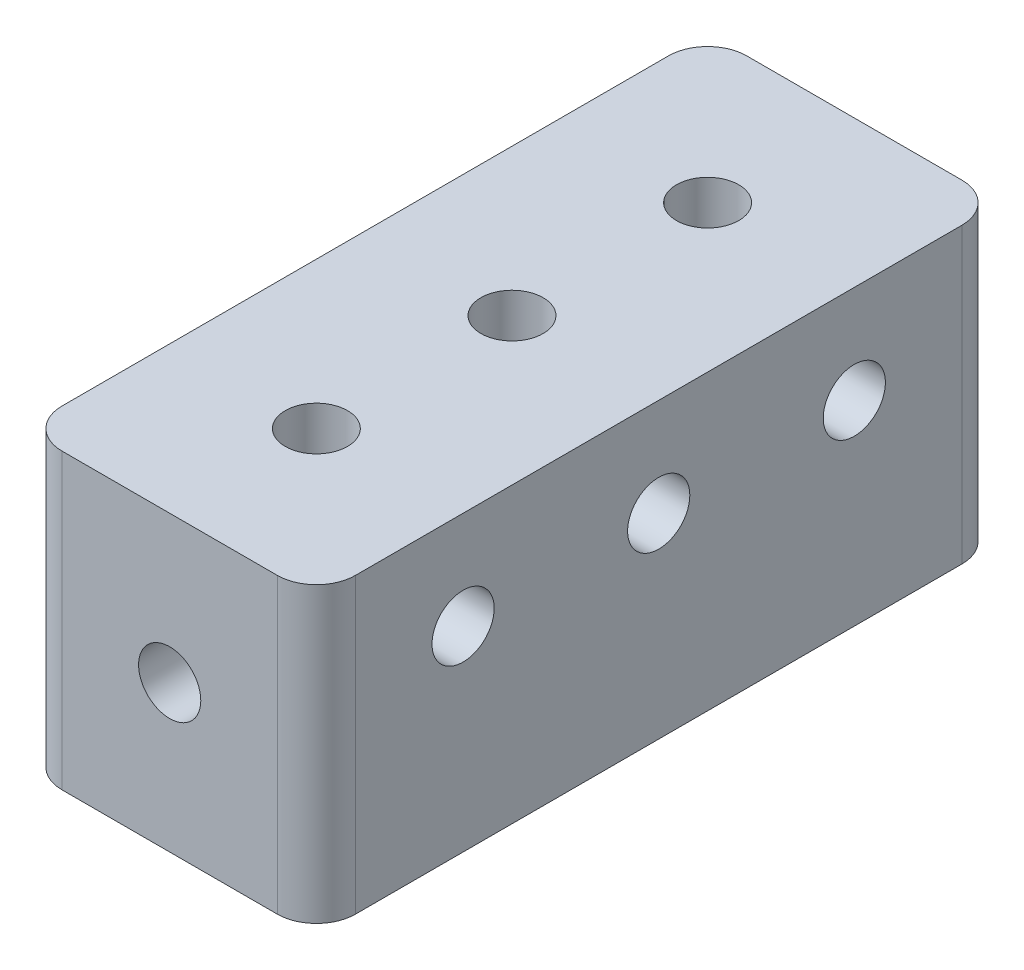
ISO-10303-21;
HEADER;
FILE_DESCRIPTION(('STEP AP214'),'2;1');
FILE_NAME('part.step','',(''),(''),'','','');
FILE_SCHEMA(('AUTOMOTIVE_DESIGN { 1 0 10303 214 1 1 1 1 }'));
ENDSEC;
DATA;
#1=APPLICATION_CONTEXT('core data for automotive mechanical design processes');
#2=APPLICATION_PROTOCOL_DEFINITION('international standard','automotive_design',2000,#1);
#3=PRODUCT_CONTEXT('',#1,'mechanical');
#4=PRODUCT('Part','Part','',(#3));
#5=PRODUCT_RELATED_PRODUCT_CATEGORY('part','',(#4));
#6=PRODUCT_DEFINITION_FORMATION('','',#4);
#7=PRODUCT_DEFINITION_CONTEXT('part definition',#1,'design');
#8=PRODUCT_DEFINITION('design','',#6,#7);
#9=PRODUCT_DEFINITION_SHAPE('','',#8);
#10=(LENGTH_UNIT() NAMED_UNIT(*) SI_UNIT(.MILLI.,.METRE.));
#11=(NAMED_UNIT(*) PLANE_ANGLE_UNIT() SI_UNIT($,.RADIAN.));
#12=(NAMED_UNIT(*) SI_UNIT($,.STERADIAN.) SOLID_ANGLE_UNIT());
#13=UNCERTAINTY_MEASURE_WITH_UNIT(LENGTH_MEASURE(1.E-05),#10,'distance_accuracy_value','');
#14=(GEOMETRIC_REPRESENTATION_CONTEXT(3) GLOBAL_UNCERTAINTY_ASSIGNED_CONTEXT((#13)) GLOBAL_UNIT_ASSIGNED_CONTEXT((#10,
#11,#12)) REPRESENTATION_CONTEXT('',''));
#15=CARTESIAN_POINT('',(0.,0.,0.));
#16=DIRECTION('',(0.,0.,1.));
#17=DIRECTION('',(1.,0.,0.));
#18=AXIS2_PLACEMENT_3D('',#15,#16,#17);
#19=CARTESIAN_POINT('',(9.525,9.525,22.225));
#20=DIRECTION('',(-1.,0.,0.));
#21=DIRECTION('',(0.,0.,1.));
#22=AXIS2_PLACEMENT_3D('',#19,#20,#21);
#23=PLANE('',#22);
#24=CARTESIAN_POINT('',(9.525,3.175,12.7));
#25=DIRECTION('',(1.,0.,0.));
#26=DIRECTION('',(0.,0.,-1.));
#27=AXIS2_PLACEMENT_3D('',#24,#25,#26);
#28=CIRCLE('',#27,2.0193);
#29=CARTESIAN_POINT('',(9.525,3.175,10.6807));
#30=VERTEX_POINT('',#29);
#31=EDGE_CURVE('E208',#30,#30,#28,.T.);
#32=ORIENTED_EDGE('',*,*,#31,.F.);
#33=EDGE_LOOP('',(#32));
#34=FACE_BOUND('',#33,.T.);
#35=CARTESIAN_POINT('',(9.525,3.175,-12.7));
#36=DIRECTION('',(1.,0.,0.));
#37=DIRECTION('',(0.,0.,-1.));
#38=AXIS2_PLACEMENT_3D('',#35,#36,#37);
#39=CIRCLE('',#38,2.0193);
#40=CARTESIAN_POINT('',(9.525,3.175,-14.7193));
#41=VERTEX_POINT('',#40);
#42=EDGE_CURVE('E202',#41,#41,#39,.T.);
#43=ORIENTED_EDGE('',*,*,#42,.F.);
#44=EDGE_LOOP('',(#43));
#45=FACE_BOUND('',#44,.T.);
#46=CARTESIAN_POINT('',(9.525,3.175,0.));
#47=DIRECTION('',(1.,0.,0.));
#48=DIRECTION('',(0.,0.,-1.));
#49=AXIS2_PLACEMENT_3D('',#46,#47,#48);
#50=CIRCLE('',#49,2.0193);
#51=CARTESIAN_POINT('',(9.525,3.175,-2.0193));
#52=VERTEX_POINT('',#51);
#53=EDGE_CURVE('E195',#52,#52,#50,.T.);
#54=ORIENTED_EDGE('',*,*,#53,.F.);
#55=EDGE_LOOP('',(#54));
#56=FACE_BOUND('',#55,.T.);
#57=DIRECTION('',(0.,0.,-1.));
#58=VECTOR('',#57,1.);
#59=CARTESIAN_POINT('',(9.525,9.525,22.225));
#60=LINE('',#59,#58);
#61=CARTESIAN_POINT('',(9.525,9.525,19.685));
#62=VERTEX_POINT('',#61);
#63=CARTESIAN_POINT('',(9.525,9.525,-19.685));
#64=VERTEX_POINT('',#63);
#65=EDGE_CURVE('E126',#62,#64,#60,.T.);
#66=ORIENTED_EDGE('',*,*,#65,.F.);
#67=DIRECTION('',(0.,-1.,0.));
#68=VECTOR('',#67,1.);
#69=CARTESIAN_POINT('',(9.525,9.525,19.685));
#70=LINE('',#69,#68);
#71=CARTESIAN_POINT('',(9.525,-9.525,19.685));
#72=VERTEX_POINT('',#71);
#73=EDGE_CURVE('E111',#62,#72,#70,.T.);
#74=ORIENTED_EDGE('',*,*,#73,.T.);
#75=DIRECTION('',(0.,0.,-1.));
#76=VECTOR('',#75,1.);
#77=CARTESIAN_POINT('',(9.525,-9.525,22.225));
#78=LINE('',#77,#76);
#79=CARTESIAN_POINT('',(9.525,-9.525,-19.685));
#80=VERTEX_POINT('',#79);
#81=EDGE_CURVE('E123',#72,#80,#78,.T.);
#82=ORIENTED_EDGE('',*,*,#81,.T.);
#83=DIRECTION('',(0.,-1.,0.));
#84=VECTOR('',#83,1.);
#85=CARTESIAN_POINT('',(9.525,9.525,-19.685));
#86=LINE('',#85,#84);
#87=EDGE_CURVE('E128',#80,#64,#86,.F.);
#88=ORIENTED_EDGE('',*,*,#87,.T.);
#89=EDGE_LOOP('',(#66,#74,#82,#88));
#90=FACE_BOUND('',#89,.T.);
#91=ADVANCED_FACE('F41',(#34,#45,#56,#90),#23,.F.);
#92=CARTESIAN_POINT('',(-9.525,9.525,-22.225));
#93=DIRECTION('',(0.,0.,1.));
#94=DIRECTION('',(1.,0.,0.));
#95=AXIS2_PLACEMENT_3D('',#92,#93,#94);
#96=PLANE('',#95);
#97=CARTESIAN_POINT('',(0.,0.,-22.225));
#98=DIRECTION('',(0.,0.,-1.));
#99=DIRECTION('',(-1.,0.,0.));
#100=AXIS2_PLACEMENT_3D('',#97,#98,#99);
#101=CIRCLE('',#100,2.0193);
#102=CARTESIAN_POINT('',(-2.0193,0.,-22.225));
#103=VERTEX_POINT('',#102);
#104=EDGE_CURVE('E189',#103,#103,#101,.T.);
#105=ORIENTED_EDGE('',*,*,#104,.F.);
#106=EDGE_LOOP('',(#105));
#107=FACE_BOUND('',#106,.T.);
#108=DIRECTION('',(-1.,0.,0.));
#109=VECTOR('',#108,1.);
#110=CARTESIAN_POINT('',(-9.525,-9.525,-22.225));
#111=LINE('',#110,#109);
#112=CARTESIAN_POINT('',(6.98499999999999,-9.525,-22.225));
#113=VERTEX_POINT('',#112);
#114=CARTESIAN_POINT('',(-6.985,-9.525,-22.225));
#115=VERTEX_POINT('',#114);
#116=EDGE_CURVE('E132',#113,#115,#111,.T.);
#117=ORIENTED_EDGE('',*,*,#116,.T.);
#118=DIRECTION('',(0.,-1.,0.));
#119=VECTOR('',#118,1.);
#120=CARTESIAN_POINT('',(-6.985,9.525,-22.225));
#121=LINE('',#120,#119);
#122=CARTESIAN_POINT('',(-6.985,9.525,-22.225));
#123=VERTEX_POINT('',#122);
#124=EDGE_CURVE('E11',#115,#123,#121,.F.);
#125=ORIENTED_EDGE('',*,*,#124,.T.);
#126=DIRECTION('',(-1.,0.,0.));
#127=VECTOR('',#126,1.);
#128=CARTESIAN_POINT('',(-9.525,9.525,-22.225));
#129=LINE('',#128,#127);
#130=CARTESIAN_POINT('',(6.98499999999999,9.525,-22.225));
#131=VERTEX_POINT('',#130);
#132=EDGE_CURVE('E172',#131,#123,#129,.T.);
#133=ORIENTED_EDGE('',*,*,#132,.F.);
#134=DIRECTION('',(0.,-1.,0.));
#135=VECTOR('',#134,1.);
#136=CARTESIAN_POINT('',(6.985,9.525,-22.225));
#137=LINE('',#136,#135);
#138=EDGE_CURVE('E49',#131,#113,#137,.T.);
#139=ORIENTED_EDGE('',*,*,#138,.T.);
#140=EDGE_LOOP('',(#117,#125,#133,#139));
#141=FACE_BOUND('',#140,.T.);
#142=ADVANCED_FACE('F170',(#107,#141),#96,.F.);
#143=CARTESIAN_POINT('',(-9.525,9.525,22.225));
#144=DIRECTION('',(1.,0.,0.));
#145=DIRECTION('',(0.,0.,-1.));
#146=AXIS2_PLACEMENT_3D('',#143,#144,#145);
#147=PLANE('',#146);
#148=CARTESIAN_POINT('',(-9.525,3.175,-12.7));
#149=DIRECTION('',(-1.,0.,0.));
#150=DIRECTION('',(0.,0.,1.));
#151=AXIS2_PLACEMENT_3D('',#148,#149,#150);
#152=CIRCLE('',#151,2.0193);
#153=CARTESIAN_POINT('',(-9.525,3.175,-10.6807));
#154=VERTEX_POINT('',#153);
#155=EDGE_CURVE('E226',#154,#154,#152,.T.);
#156=ORIENTED_EDGE('',*,*,#155,.F.);
#157=EDGE_LOOP('',(#156));
#158=FACE_BOUND('',#157,.T.);
#159=CARTESIAN_POINT('',(-9.525,3.175,0.));
#160=DIRECTION('',(-1.,0.,0.));
#161=DIRECTION('',(0.,0.,1.));
#162=AXIS2_PLACEMENT_3D('',#159,#160,#161);
#163=CIRCLE('',#162,2.0193);
#164=CARTESIAN_POINT('',(-9.525,3.175,2.0193));
#165=VERTEX_POINT('',#164);
#166=EDGE_CURVE('E220',#165,#165,#163,.T.);
#167=ORIENTED_EDGE('',*,*,#166,.F.);
#168=EDGE_LOOP('',(#167));
#169=FACE_BOUND('',#168,.T.);
#170=CARTESIAN_POINT('',(-9.525,3.175,12.7));
#171=DIRECTION('',(-1.,0.,0.));
#172=DIRECTION('',(0.,0.,1.));
#173=AXIS2_PLACEMENT_3D('',#170,#171,#172);
#174=CIRCLE('',#173,2.0193);
#175=CARTESIAN_POINT('',(-9.525,3.175,14.7193));
#176=VERTEX_POINT('',#175);
#177=EDGE_CURVE('E213',#176,#176,#174,.T.);
#178=ORIENTED_EDGE('',*,*,#177,.F.);
#179=EDGE_LOOP('',(#178));
#180=FACE_BOUND('',#179,.T.);
#181=DIRECTION('',(0.,0.,1.));
#182=VECTOR('',#181,1.);
#183=CARTESIAN_POINT('',(-9.525,-9.525,22.225));
#184=LINE('',#183,#182);
#185=CARTESIAN_POINT('',(-9.525,-9.525,-19.685));
#186=VERTEX_POINT('',#185);
#187=CARTESIAN_POINT('',(-9.525,-9.525,19.685));
#188=VERTEX_POINT('',#187);
#189=EDGE_CURVE('E136',#186,#188,#184,.T.);
#190=ORIENTED_EDGE('',*,*,#189,.T.);
#191=DIRECTION('',(0.,-1.,0.));
#192=VECTOR('',#191,1.);
#193=CARTESIAN_POINT('',(-9.525,9.525,19.685));
#194=LINE('',#193,#192);
#195=CARTESIAN_POINT('',(-9.525,9.525,19.685));
#196=VERTEX_POINT('',#195);
#197=EDGE_CURVE('E56',#188,#196,#194,.F.);
#198=ORIENTED_EDGE('',*,*,#197,.T.);
#199=DIRECTION('',(0.,0.,1.));
#200=VECTOR('',#199,1.);
#201=CARTESIAN_POINT('',(-9.525,9.525,22.225));
#202=LINE('',#201,#200);
#203=CARTESIAN_POINT('',(-9.525,9.525,-19.685));
#204=VERTEX_POINT('',#203);
#205=EDGE_CURVE('E180',#204,#196,#202,.T.);
#206=ORIENTED_EDGE('',*,*,#205,.F.);
#207=DIRECTION('',(0.,-1.,0.));
#208=VECTOR('',#207,1.);
#209=CARTESIAN_POINT('',(-9.525,9.525,-19.685));
#210=LINE('',#209,#208);
#211=EDGE_CURVE('E163',#204,#186,#210,.T.);
#212=ORIENTED_EDGE('',*,*,#211,.T.);
#213=EDGE_LOOP('',(#190,#198,#206,#212));
#214=FACE_BOUND('',#213,.T.);
#215=ADVANCED_FACE('F179',(#158,#169,#180,#214),#147,.F.);
#216=CARTESIAN_POINT('',(-9.525,9.525,22.225));
#217=DIRECTION('',(0.,0.,-1.));
#218=DIRECTION('',(-1.,0.,0.));
#219=AXIS2_PLACEMENT_3D('',#216,#217,#218);
#220=PLANE('',#219);
#221=CARTESIAN_POINT('',(0.,0.,22.225));
#222=DIRECTION('',(0.,0.,1.));
#223=DIRECTION('',(1.,0.,0.));
#224=AXIS2_PLACEMENT_3D('',#221,#222,#223);
#225=CIRCLE('',#224,2.0193);
#226=CARTESIAN_POINT('',(2.0193,0.,22.225));
#227=VERTEX_POINT('',#226);
#228=EDGE_CURVE('E139',#227,#227,#225,.T.);
#229=ORIENTED_EDGE('',*,*,#228,.F.);
#230=EDGE_LOOP('',(#229));
#231=FACE_BOUND('',#230,.T.);
#232=DIRECTION('',(1.,0.,0.));
#233=VECTOR('',#232,1.);
#234=CARTESIAN_POINT('',(-9.525,-9.525,22.225));
#235=LINE('',#234,#233);
#236=CARTESIAN_POINT('',(-6.985,-9.525,22.225));
#237=VERTEX_POINT('',#236);
#238=CARTESIAN_POINT('',(6.98499999999999,-9.525,22.225));
#239=VERTEX_POINT('',#238);
#240=EDGE_CURVE('E146',#237,#239,#235,.T.);
#241=ORIENTED_EDGE('',*,*,#240,.T.);
#242=DIRECTION('',(0.,-1.,0.));
#243=VECTOR('',#242,1.);
#244=CARTESIAN_POINT('',(6.985,9.525,22.225));
#245=LINE('',#244,#243);
#246=CARTESIAN_POINT('',(6.98499999999999,9.525,22.225));
#247=VERTEX_POINT('',#246);
#248=EDGE_CURVE('E112',#239,#247,#245,.F.);
#249=ORIENTED_EDGE('',*,*,#248,.T.);
#250=DIRECTION('',(1.,0.,0.));
#251=VECTOR('',#250,1.);
#252=CARTESIAN_POINT('',(-9.525,9.525,22.225));
#253=LINE('',#252,#251);
#254=CARTESIAN_POINT('',(-6.985,9.525,22.225));
#255=VERTEX_POINT('',#254);
#256=EDGE_CURVE('E142',#255,#247,#253,.T.);
#257=ORIENTED_EDGE('',*,*,#256,.F.);
#258=DIRECTION('',(0.,-1.,0.));
#259=VECTOR('',#258,1.);
#260=CARTESIAN_POINT('',(-6.985,9.525,22.225));
#261=LINE('',#260,#259);
#262=EDGE_CURVE('E117',#255,#237,#261,.T.);
#263=ORIENTED_EDGE('',*,*,#262,.T.);
#264=EDGE_LOOP('',(#241,#249,#257,#263));
#265=FACE_BOUND('',#264,.T.);
#266=ADVANCED_FACE('F261',(#231,#265),#220,.F.);
#267=CARTESIAN_POINT('',(0.,9.525,0.));
#268=DIRECTION('',(0.,-1.,0.));
#269=DIRECTION('',(0.,0.,-1.));
#270=AXIS2_PLACEMENT_3D('',#267,#268,#269);
#271=PLANE('',#270);
#272=CARTESIAN_POINT('',(0.,9.525,-12.7));
#273=DIRECTION('',(0.,1.,0.));
#274=DIRECTION('',(0.,0.,1.));
#275=AXIS2_PLACEMENT_3D('',#272,#273,#274);
#276=CIRCLE('',#275,2.0193);
#277=CARTESIAN_POINT('',(0.,9.525,-10.6807));
#278=VERTEX_POINT('',#277);
#279=EDGE_CURVE('E243',#278,#278,#276,.T.);
#280=ORIENTED_EDGE('',*,*,#279,.F.);
#281=EDGE_LOOP('',(#280));
#282=FACE_BOUND('',#281,.T.);
#283=CARTESIAN_POINT('',(0.,9.525,0.));
#284=DIRECTION('',(0.,1.,0.));
#285=DIRECTION('',(0.,0.,1.));
#286=AXIS2_PLACEMENT_3D('',#283,#284,#285);
#287=CIRCLE('',#286,2.0193);
#288=CARTESIAN_POINT('',(0.,9.525,2.0193));
#289=VERTEX_POINT('',#288);
#290=EDGE_CURVE('E237',#289,#289,#287,.T.);
#291=ORIENTED_EDGE('',*,*,#290,.F.);
#292=EDGE_LOOP('',(#291));
#293=FACE_BOUND('',#292,.T.);
#294=CARTESIAN_POINT('',(0.,9.525,12.7));
#295=DIRECTION('',(0.,1.,0.));
#296=DIRECTION('',(0.,0.,1.));
#297=AXIS2_PLACEMENT_3D('',#294,#295,#296);
#298=CIRCLE('',#297,2.0193);
#299=CARTESIAN_POINT('',(0.,9.525,14.7193));
#300=VERTEX_POINT('',#299);
#301=EDGE_CURVE('E231',#300,#300,#298,.T.);
#302=ORIENTED_EDGE('',*,*,#301,.F.);
#303=EDGE_LOOP('',(#302));
#304=FACE_BOUND('',#303,.T.);
#305=ORIENTED_EDGE('',*,*,#256,.T.);
#306=CARTESIAN_POINT('',(6.985,9.525,19.685));
#307=DIRECTION('',(0.,-1.,0.));
#308=DIRECTION('',(0.,0.,-1.));
#309=AXIS2_PLACEMENT_3D('',#306,#307,#308);
#310=CIRCLE('',#309,2.54);
#311=EDGE_CURVE('E161',#247,#62,#310,.F.);
#312=ORIENTED_EDGE('',*,*,#311,.T.);
#313=ORIENTED_EDGE('',*,*,#65,.T.);
#314=CARTESIAN_POINT('',(6.985,9.525,-19.685));
#315=DIRECTION('',(0.,-1.,0.));
#316=DIRECTION('',(0.,0.,-1.));
#317=AXIS2_PLACEMENT_3D('',#314,#315,#316);
#318=CIRCLE('',#317,2.54);
#319=EDGE_CURVE('E156',#64,#131,#318,.F.);
#320=ORIENTED_EDGE('',*,*,#319,.T.);
#321=ORIENTED_EDGE('',*,*,#132,.T.);
#322=CARTESIAN_POINT('',(-6.985,9.525,-19.685));
#323=DIRECTION('',(0.,-1.,0.));
#324=DIRECTION('',(0.,0.,-1.));
#325=AXIS2_PLACEMENT_3D('',#322,#323,#324);
#326=CIRCLE('',#325,2.54);
#327=EDGE_CURVE('E63',#123,#204,#326,.F.);
#328=ORIENTED_EDGE('',*,*,#327,.T.);
#329=ORIENTED_EDGE('',*,*,#205,.T.);
#330=CARTESIAN_POINT('',(-6.985,9.525,19.685));
#331=DIRECTION('',(0.,-1.,0.));
#332=DIRECTION('',(0.,0.,-1.));
#333=AXIS2_PLACEMENT_3D('',#330,#331,#332);
#334=CIRCLE('',#333,2.54);
#335=EDGE_CURVE('E159',#196,#255,#334,.F.);
#336=ORIENTED_EDGE('',*,*,#335,.T.);
#337=EDGE_LOOP('',(#305,#312,#313,#320,#321,#328,#329,#336));
#338=FACE_BOUND('',#337,.T.);
#339=ADVANCED_FACE('F258',(#282,#293,#304,#338),#271,.F.);
#340=CARTESIAN_POINT('',(0.,-9.525,0.));
#341=DIRECTION('',(0.,-1.,0.));
#342=DIRECTION('',(0.,0.,-1.));
#343=AXIS2_PLACEMENT_3D('',#340,#341,#342);
#344=PLANE('',#343);
#345=ORIENTED_EDGE('',*,*,#81,.F.);
#346=CARTESIAN_POINT('',(6.985,-9.525,19.685));
#347=DIRECTION('',(0.,-1.,0.));
#348=DIRECTION('',(0.,0.,-1.));
#349=AXIS2_PLACEMENT_3D('',#346,#347,#348);
#350=CIRCLE('',#349,2.54);
#351=EDGE_CURVE('E107',#72,#239,#350,.T.);
#352=ORIENTED_EDGE('',*,*,#351,.T.);
#353=ORIENTED_EDGE('',*,*,#240,.F.);
#354=CARTESIAN_POINT('',(-6.985,-9.525,19.685));
#355=DIRECTION('',(0.,-1.,0.));
#356=DIRECTION('',(0.,0.,-1.));
#357=AXIS2_PLACEMENT_3D('',#354,#355,#356);
#358=CIRCLE('',#357,2.54);
#359=EDGE_CURVE('E118',#237,#188,#358,.T.);
#360=ORIENTED_EDGE('',*,*,#359,.T.);
#361=ORIENTED_EDGE('',*,*,#189,.F.);
#362=CARTESIAN_POINT('',(-6.985,-9.525,-19.685));
#363=DIRECTION('',(0.,-1.,0.));
#364=DIRECTION('',(0.,0.,-1.));
#365=AXIS2_PLACEMENT_3D('',#362,#363,#364);
#366=CIRCLE('',#365,2.54);
#367=EDGE_CURVE('E150',#186,#115,#366,.T.);
#368=ORIENTED_EDGE('',*,*,#367,.T.);
#369=ORIENTED_EDGE('',*,*,#116,.F.);
#370=CARTESIAN_POINT('',(6.985,-9.525,-19.685));
#371=DIRECTION('',(0.,-1.,0.));
#372=DIRECTION('',(0.,0.,-1.));
#373=AXIS2_PLACEMENT_3D('',#370,#371,#372);
#374=CIRCLE('',#373,2.54);
#375=EDGE_CURVE('E127',#113,#80,#374,.T.);
#376=ORIENTED_EDGE('',*,*,#375,.T.);
#377=EDGE_LOOP('',(#345,#352,#353,#360,#361,#368,#369,#376));
#378=FACE_BOUND('',#377,.T.);
#379=ADVANCED_FACE('F130',(#378),#344,.T.);
#380=CARTESIAN_POINT('',(0.,0.,12.7));
#381=DIRECTION('',(0.,0.,1.));
#382=DIRECTION('',(1.,0.,0.));
#383=AXIS2_PLACEMENT_3D('',#380,#381,#382);
#384=CYLINDRICAL_SURFACE('',#383,2.0193);
#385=CARTESIAN_POINT('',(0.,0.,12.7));
#386=DIRECTION('',(0.,0.,1.));
#387=DIRECTION('',(1.,0.,0.));
#388=AXIS2_PLACEMENT_3D('',#385,#386,#387);
#389=CIRCLE('',#388,2.0193);
#390=CARTESIAN_POINT('',(2.0193,0.,12.7));
#391=VERTEX_POINT('',#390);
#392=EDGE_CURVE('E133',#391,#391,#389,.T.);
#393=ORIENTED_EDGE('',*,*,#392,.F.);
#394=EDGE_LOOP('',(#393));
#395=FACE_BOUND('',#394,.T.);
#396=ORIENTED_EDGE('',*,*,#228,.T.);
#397=EDGE_LOOP('',(#396));
#398=FACE_BOUND('',#397,.T.);
#399=ADVANCED_FACE('F296',(#395,#398),#384,.F.);
#400=CARTESIAN_POINT('',(0.,0.,12.7));
#401=DIRECTION('',(0.,0.,1.));
#402=DIRECTION('',(1.,0.,0.));
#403=AXIS2_PLACEMENT_3D('',#400,#401,#402);
#404=PLANE('',#403);
#405=ORIENTED_EDGE('',*,*,#392,.T.);
#406=EDGE_LOOP('',(#405));
#407=FACE_BOUND('',#406,.T.);
#408=ADVANCED_FACE('F300',(#407),#404,.T.);
#409=CARTESIAN_POINT('',(0.,0.,-12.7));
#410=DIRECTION('',(0.,0.,-1.));
#411=DIRECTION('',(-1.,0.,0.));
#412=AXIS2_PLACEMENT_3D('',#409,#410,#411);
#413=CYLINDRICAL_SURFACE('',#412,2.0193);
#414=CARTESIAN_POINT('',(0.,0.,-12.7));
#415=DIRECTION('',(0.,0.,-1.));
#416=DIRECTION('',(-1.,0.,0.));
#417=AXIS2_PLACEMENT_3D('',#414,#415,#416);
#418=CIRCLE('',#417,2.0193);
#419=CARTESIAN_POINT('',(-2.0193,0.,-12.7));
#420=VERTEX_POINT('',#419);
#421=EDGE_CURVE('E187',#420,#420,#418,.T.);
#422=ORIENTED_EDGE('',*,*,#421,.F.);
#423=EDGE_LOOP('',(#422));
#424=FACE_BOUND('',#423,.T.);
#425=ORIENTED_EDGE('',*,*,#104,.T.);
#426=EDGE_LOOP('',(#425));
#427=FACE_BOUND('',#426,.T.);
#428=ADVANCED_FACE('F304',(#424,#427),#413,.F.);
#429=CARTESIAN_POINT('',(0.,0.,-12.7));
#430=DIRECTION('',(0.,0.,-1.));
#431=DIRECTION('',(-1.,0.,0.));
#432=AXIS2_PLACEMENT_3D('',#429,#430,#431);
#433=PLANE('',#432);
#434=ORIENTED_EDGE('',*,*,#421,.T.);
#435=EDGE_LOOP('',(#434));
#436=FACE_BOUND('',#435,.T.);
#437=ADVANCED_FACE('F308',(#436),#433,.T.);
#438=CARTESIAN_POINT('',(3.175,3.175,0.));
#439=DIRECTION('',(1.,0.,0.));
#440=DIRECTION('',(0.,0.,-1.));
#441=AXIS2_PLACEMENT_3D('',#438,#439,#440);
#442=CYLINDRICAL_SURFACE('',#441,2.0193);
#443=CARTESIAN_POINT('',(3.175,3.175,0.));
#444=DIRECTION('',(1.,0.,0.));
#445=DIRECTION('',(0.,0.,-1.));
#446=AXIS2_PLACEMENT_3D('',#443,#444,#445);
#447=CIRCLE('',#446,2.0193);
#448=CARTESIAN_POINT('',(3.175,3.175,-2.0193));
#449=VERTEX_POINT('',#448);
#450=EDGE_CURVE('E198',#449,#449,#447,.T.);
#451=ORIENTED_EDGE('',*,*,#450,.F.);
#452=EDGE_LOOP('',(#451));
#453=FACE_BOUND('',#452,.T.);
#454=ORIENTED_EDGE('',*,*,#53,.T.);
#455=EDGE_LOOP('',(#454));
#456=FACE_BOUND('',#455,.T.);
#457=ADVANCED_FACE('F312',(#453,#456),#442,.F.);
#458=CARTESIAN_POINT('',(3.175,3.175,0.));
#459=DIRECTION('',(1.,0.,0.));
#460=DIRECTION('',(0.,0.,-1.));
#461=AXIS2_PLACEMENT_3D('',#458,#459,#460);
#462=PLANE('',#461);
#463=ORIENTED_EDGE('',*,*,#450,.T.);
#464=EDGE_LOOP('',(#463));
#465=FACE_BOUND('',#464,.T.);
#466=ADVANCED_FACE('F316',(#465),#462,.T.);
#467=CARTESIAN_POINT('',(3.175,3.175,-12.7));
#468=DIRECTION('',(1.,0.,0.));
#469=DIRECTION('',(0.,0.,-1.));
#470=AXIS2_PLACEMENT_3D('',#467,#468,#469);
#471=CYLINDRICAL_SURFACE('',#470,2.0193);
#472=CARTESIAN_POINT('',(3.175,3.175,-12.7));
#473=DIRECTION('',(1.,0.,0.));
#474=DIRECTION('',(0.,0.,-1.));
#475=AXIS2_PLACEMENT_3D('',#472,#473,#474);
#476=CIRCLE('',#475,2.0193);
#477=CARTESIAN_POINT('',(3.175,3.175,-14.7193));
#478=VERTEX_POINT('',#477);
#479=EDGE_CURVE('E205',#478,#478,#476,.T.);
#480=ORIENTED_EDGE('',*,*,#479,.F.);
#481=EDGE_LOOP('',(#480));
#482=FACE_BOUND('',#481,.T.);
#483=ORIENTED_EDGE('',*,*,#42,.T.);
#484=EDGE_LOOP('',(#483));
#485=FACE_BOUND('',#484,.T.);
#486=ADVANCED_FACE('F320',(#482,#485),#471,.F.);
#487=CARTESIAN_POINT('',(3.175,3.175,-12.7));
#488=DIRECTION('',(1.,0.,0.));
#489=DIRECTION('',(0.,0.,-1.));
#490=AXIS2_PLACEMENT_3D('',#487,#488,#489);
#491=PLANE('',#490);
#492=ORIENTED_EDGE('',*,*,#479,.T.);
#493=EDGE_LOOP('',(#492));
#494=FACE_BOUND('',#493,.T.);
#495=ADVANCED_FACE('F324',(#494),#491,.T.);
#496=CARTESIAN_POINT('',(3.175,3.175,12.7));
#497=DIRECTION('',(1.,0.,0.));
#498=DIRECTION('',(0.,0.,-1.));
#499=AXIS2_PLACEMENT_3D('',#496,#497,#498);
#500=CYLINDRICAL_SURFACE('',#499,2.0193);
#501=CARTESIAN_POINT('',(3.175,3.175,12.7));
#502=DIRECTION('',(1.,0.,0.));
#503=DIRECTION('',(0.,0.,-1.));
#504=AXIS2_PLACEMENT_3D('',#501,#502,#503);
#505=CIRCLE('',#504,2.0193);
#506=CARTESIAN_POINT('',(3.175,3.175,10.6807));
#507=VERTEX_POINT('',#506);
#508=EDGE_CURVE('E192',#507,#507,#505,.T.);
#509=ORIENTED_EDGE('',*,*,#508,.F.);
#510=EDGE_LOOP('',(#509));
#511=FACE_BOUND('',#510,.T.);
#512=ORIENTED_EDGE('',*,*,#31,.T.);
#513=EDGE_LOOP('',(#512));
#514=FACE_BOUND('',#513,.T.);
#515=ADVANCED_FACE('F328',(#511,#514),#500,.F.);
#516=CARTESIAN_POINT('',(3.175,3.175,12.7));
#517=DIRECTION('',(1.,0.,0.));
#518=DIRECTION('',(0.,0.,-1.));
#519=AXIS2_PLACEMENT_3D('',#516,#517,#518);
#520=PLANE('',#519);
#521=ORIENTED_EDGE('',*,*,#508,.T.);
#522=EDGE_LOOP('',(#521));
#523=FACE_BOUND('',#522,.T.);
#524=ADVANCED_FACE('F332',(#523),#520,.T.);
#525=CARTESIAN_POINT('',(-3.175,3.175,12.7));
#526=DIRECTION('',(-1.,0.,0.));
#527=DIRECTION('',(0.,0.,1.));
#528=AXIS2_PLACEMENT_3D('',#525,#526,#527);
#529=CYLINDRICAL_SURFACE('',#528,2.0193);
#530=CARTESIAN_POINT('',(-3.175,3.175,12.7));
#531=DIRECTION('',(-1.,0.,0.));
#532=DIRECTION('',(0.,0.,1.));
#533=AXIS2_PLACEMENT_3D('',#530,#531,#532);
#534=CIRCLE('',#533,2.0193);
#535=CARTESIAN_POINT('',(-3.175,3.175,14.7193));
#536=VERTEX_POINT('',#535);
#537=EDGE_CURVE('E216',#536,#536,#534,.T.);
#538=ORIENTED_EDGE('',*,*,#537,.F.);
#539=EDGE_LOOP('',(#538));
#540=FACE_BOUND('',#539,.T.);
#541=ORIENTED_EDGE('',*,*,#177,.T.);
#542=EDGE_LOOP('',(#541));
#543=FACE_BOUND('',#542,.T.);
#544=ADVANCED_FACE('F336',(#540,#543),#529,.F.);
#545=CARTESIAN_POINT('',(-3.175,3.175,12.7));
#546=DIRECTION('',(-1.,0.,0.));
#547=DIRECTION('',(0.,0.,1.));
#548=AXIS2_PLACEMENT_3D('',#545,#546,#547);
#549=PLANE('',#548);
#550=ORIENTED_EDGE('',*,*,#537,.T.);
#551=EDGE_LOOP('',(#550));
#552=FACE_BOUND('',#551,.T.);
#553=ADVANCED_FACE('F340',(#552),#549,.T.);
#554=CARTESIAN_POINT('',(-3.175,3.175,0.));
#555=DIRECTION('',(-1.,0.,0.));
#556=DIRECTION('',(0.,0.,1.));
#557=AXIS2_PLACEMENT_3D('',#554,#555,#556);
#558=CYLINDRICAL_SURFACE('',#557,2.0193);
#559=CARTESIAN_POINT('',(-3.175,3.175,0.));
#560=DIRECTION('',(-1.,0.,0.));
#561=DIRECTION('',(0.,0.,1.));
#562=AXIS2_PLACEMENT_3D('',#559,#560,#561);
#563=CIRCLE('',#562,2.0193);
#564=CARTESIAN_POINT('',(-3.175,3.175,2.0193));
#565=VERTEX_POINT('',#564);
#566=EDGE_CURVE('E223',#565,#565,#563,.T.);
#567=ORIENTED_EDGE('',*,*,#566,.F.);
#568=EDGE_LOOP('',(#567));
#569=FACE_BOUND('',#568,.T.);
#570=ORIENTED_EDGE('',*,*,#166,.T.);
#571=EDGE_LOOP('',(#570));
#572=FACE_BOUND('',#571,.T.);
#573=ADVANCED_FACE('F344',(#569,#572),#558,.F.);
#574=CARTESIAN_POINT('',(-3.175,3.175,0.));
#575=DIRECTION('',(-1.,0.,0.));
#576=DIRECTION('',(0.,0.,1.));
#577=AXIS2_PLACEMENT_3D('',#574,#575,#576);
#578=PLANE('',#577);
#579=ORIENTED_EDGE('',*,*,#566,.T.);
#580=EDGE_LOOP('',(#579));
#581=FACE_BOUND('',#580,.T.);
#582=ADVANCED_FACE('F348',(#581),#578,.T.);
#583=CARTESIAN_POINT('',(-3.175,3.175,-12.7));
#584=DIRECTION('',(-1.,0.,0.));
#585=DIRECTION('',(0.,0.,1.));
#586=AXIS2_PLACEMENT_3D('',#583,#584,#585);
#587=CYLINDRICAL_SURFACE('',#586,2.0193);
#588=CARTESIAN_POINT('',(-3.175,3.175,-12.7));
#589=DIRECTION('',(-1.,0.,0.));
#590=DIRECTION('',(0.,0.,1.));
#591=AXIS2_PLACEMENT_3D('',#588,#589,#590);
#592=CIRCLE('',#591,2.0193);
#593=CARTESIAN_POINT('',(-3.175,3.175,-10.6807));
#594=VERTEX_POINT('',#593);
#595=EDGE_CURVE('E199',#594,#594,#592,.T.);
#596=ORIENTED_EDGE('',*,*,#595,.F.);
#597=EDGE_LOOP('',(#596));
#598=FACE_BOUND('',#597,.T.);
#599=ORIENTED_EDGE('',*,*,#155,.T.);
#600=EDGE_LOOP('',(#599));
#601=FACE_BOUND('',#600,.T.);
#602=ADVANCED_FACE('F352',(#598,#601),#587,.F.);
#603=CARTESIAN_POINT('',(-3.175,3.175,-12.7));
#604=DIRECTION('',(-1.,0.,0.));
#605=DIRECTION('',(0.,0.,1.));
#606=AXIS2_PLACEMENT_3D('',#603,#604,#605);
#607=PLANE('',#606);
#608=ORIENTED_EDGE('',*,*,#595,.T.);
#609=EDGE_LOOP('',(#608));
#610=FACE_BOUND('',#609,.T.);
#611=ADVANCED_FACE('F356',(#610),#607,.T.);
#612=CARTESIAN_POINT('',(0.,3.175,12.7));
#613=DIRECTION('',(0.,1.,0.));
#614=DIRECTION('',(0.,0.,1.));
#615=AXIS2_PLACEMENT_3D('',#612,#613,#614);
#616=CYLINDRICAL_SURFACE('',#615,2.0193);
#617=CARTESIAN_POINT('',(0.,3.175,12.7));
#618=DIRECTION('',(0.,1.,0.));
#619=DIRECTION('',(0.,0.,1.));
#620=AXIS2_PLACEMENT_3D('',#617,#618,#619);
#621=CIRCLE('',#620,2.0193);
#622=CARTESIAN_POINT('',(0.,3.175,14.7193));
#623=VERTEX_POINT('',#622);
#624=EDGE_CURVE('E234',#623,#623,#621,.T.);
#625=ORIENTED_EDGE('',*,*,#624,.F.);
#626=EDGE_LOOP('',(#625));
#627=FACE_BOUND('',#626,.T.);
#628=ORIENTED_EDGE('',*,*,#301,.T.);
#629=EDGE_LOOP('',(#628));
#630=FACE_BOUND('',#629,.T.);
#631=ADVANCED_FACE('F360',(#627,#630),#616,.F.);
#632=CARTESIAN_POINT('',(0.,3.175,12.7));
#633=DIRECTION('',(0.,1.,0.));
#634=DIRECTION('',(0.,0.,1.));
#635=AXIS2_PLACEMENT_3D('',#632,#633,#634);
#636=PLANE('',#635);
#637=ORIENTED_EDGE('',*,*,#624,.T.);
#638=EDGE_LOOP('',(#637));
#639=FACE_BOUND('',#638,.T.);
#640=ADVANCED_FACE('F364',(#639),#636,.T.);
#641=CARTESIAN_POINT('',(0.,3.175,0.));
#642=DIRECTION('',(0.,1.,0.));
#643=DIRECTION('',(0.,0.,1.));
#644=AXIS2_PLACEMENT_3D('',#641,#642,#643);
#645=CYLINDRICAL_SURFACE('',#644,2.0193);
#646=CARTESIAN_POINT('',(0.,3.175,0.));
#647=DIRECTION('',(0.,1.,0.));
#648=DIRECTION('',(0.,0.,1.));
#649=AXIS2_PLACEMENT_3D('',#646,#647,#648);
#650=CIRCLE('',#649,2.0193);
#651=CARTESIAN_POINT('',(0.,3.175,2.0193));
#652=VERTEX_POINT('',#651);
#653=EDGE_CURVE('E240',#652,#652,#650,.T.);
#654=ORIENTED_EDGE('',*,*,#653,.F.);
#655=EDGE_LOOP('',(#654));
#656=FACE_BOUND('',#655,.T.);
#657=ORIENTED_EDGE('',*,*,#290,.T.);
#658=EDGE_LOOP('',(#657));
#659=FACE_BOUND('',#658,.T.);
#660=ADVANCED_FACE('F368',(#656,#659),#645,.F.);
#661=CARTESIAN_POINT('',(0.,3.175,0.));
#662=DIRECTION('',(0.,1.,0.));
#663=DIRECTION('',(0.,0.,1.));
#664=AXIS2_PLACEMENT_3D('',#661,#662,#663);
#665=PLANE('',#664);
#666=ORIENTED_EDGE('',*,*,#653,.T.);
#667=EDGE_LOOP('',(#666));
#668=FACE_BOUND('',#667,.T.);
#669=ADVANCED_FACE('F254',(#668),#665,.T.);
#670=CARTESIAN_POINT('',(0.,3.175,-12.7));
#671=DIRECTION('',(0.,1.,0.));
#672=DIRECTION('',(0.,0.,1.));
#673=AXIS2_PLACEMENT_3D('',#670,#671,#672);
#674=CYLINDRICAL_SURFACE('',#673,2.0193);
#675=CARTESIAN_POINT('',(0.,3.175,-12.7));
#676=DIRECTION('',(0.,1.,0.));
#677=DIRECTION('',(0.,0.,1.));
#678=AXIS2_PLACEMENT_3D('',#675,#676,#677);
#679=CIRCLE('',#678,2.0193);
#680=CARTESIAN_POINT('',(0.,3.175,-10.6807));
#681=VERTEX_POINT('',#680);
#682=EDGE_CURVE('E217',#681,#681,#679,.T.);
#683=ORIENTED_EDGE('',*,*,#682,.F.);
#684=EDGE_LOOP('',(#683));
#685=FACE_BOUND('',#684,.T.);
#686=ORIENTED_EDGE('',*,*,#279,.T.);
#687=EDGE_LOOP('',(#686));
#688=FACE_BOUND('',#687,.T.);
#689=ADVANCED_FACE('F251',(#685,#688),#674,.F.);
#690=CARTESIAN_POINT('',(0.,3.175,-12.7));
#691=DIRECTION('',(0.,1.,0.));
#692=DIRECTION('',(0.,0.,1.));
#693=AXIS2_PLACEMENT_3D('',#690,#691,#692);
#694=PLANE('',#693);
#695=ORIENTED_EDGE('',*,*,#682,.T.);
#696=EDGE_LOOP('',(#695));
#697=FACE_BOUND('',#696,.T.);
#698=ADVANCED_FACE('F249',(#697),#694,.T.);
#699=CARTESIAN_POINT('',(6.985,9.525,19.685));
#700=DIRECTION('',(0.,-1.,0.));
#701=DIRECTION('',(0.,0.,-1.));
#702=AXIS2_PLACEMENT_3D('',#699,#700,#701);
#703=CYLINDRICAL_SURFACE('',#702,2.54);
#704=ORIENTED_EDGE('',*,*,#311,.F.);
#705=ORIENTED_EDGE('',*,*,#248,.F.);
#706=ORIENTED_EDGE('',*,*,#351,.F.);
#707=ORIENTED_EDGE('',*,*,#73,.F.);
#708=EDGE_LOOP('',(#704,#705,#706,#707));
#709=FACE_BOUND('',#708,.T.);
#710=ADVANCED_FACE('F110',(#709),#703,.T.);
#711=CARTESIAN_POINT('',(-6.985,9.525,19.685));
#712=DIRECTION('',(0.,-1.,0.));
#713=DIRECTION('',(0.,0.,-1.));
#714=AXIS2_PLACEMENT_3D('',#711,#712,#713);
#715=CYLINDRICAL_SURFACE('',#714,2.54);
#716=ORIENTED_EDGE('',*,*,#335,.F.);
#717=ORIENTED_EDGE('',*,*,#197,.F.);
#718=ORIENTED_EDGE('',*,*,#359,.F.);
#719=ORIENTED_EDGE('',*,*,#262,.F.);
#720=EDGE_LOOP('',(#716,#717,#718,#719));
#721=FACE_BOUND('',#720,.T.);
#722=ADVANCED_FACE('F270',(#721),#715,.T.);
#723=CARTESIAN_POINT('',(-6.985,9.525,-19.685));
#724=DIRECTION('',(0.,-1.,0.));
#725=DIRECTION('',(0.,0.,-1.));
#726=AXIS2_PLACEMENT_3D('',#723,#724,#725);
#727=CYLINDRICAL_SURFACE('',#726,2.54);
#728=ORIENTED_EDGE('',*,*,#327,.F.);
#729=ORIENTED_EDGE('',*,*,#124,.F.);
#730=ORIENTED_EDGE('',*,*,#367,.F.);
#731=ORIENTED_EDGE('',*,*,#211,.F.);
#732=EDGE_LOOP('',(#728,#729,#730,#731));
#733=FACE_BOUND('',#732,.T.);
#734=ADVANCED_FACE('F178',(#733),#727,.T.);
#735=CARTESIAN_POINT('',(6.985,9.525,-19.685));
#736=DIRECTION('',(0.,-1.,0.));
#737=DIRECTION('',(0.,0.,-1.));
#738=AXIS2_PLACEMENT_3D('',#735,#736,#737);
#739=CYLINDRICAL_SURFACE('',#738,2.54);
#740=ORIENTED_EDGE('',*,*,#319,.F.);
#741=ORIENTED_EDGE('',*,*,#87,.F.);
#742=ORIENTED_EDGE('',*,*,#375,.F.);
#743=ORIENTED_EDGE('',*,*,#138,.F.);
#744=EDGE_LOOP('',(#740,#741,#742,#743));
#745=FACE_BOUND('',#744,.T.);
#746=ADVANCED_FACE('F43',(#745),#739,.T.);
#747=CLOSED_SHELL('',(#91,#142,#215,#266,#339,#379,#399,#408,#428,#437,#457,#466,#486,#495,#515,
#524,#544,#553,#573,#582,#602,#611,#631,#640,#660,#669,#689,#698,#710,#722,#734,#746));
#748=MANIFOLD_SOLID_BREP('B2',#747);
#749=ADVANCED_BREP_SHAPE_REPRESENTATION('',(#18,#748),#14);
#750=SHAPE_DEFINITION_REPRESENTATION(#9,#749);
ENDSEC;
END-ISO-10303-21;
